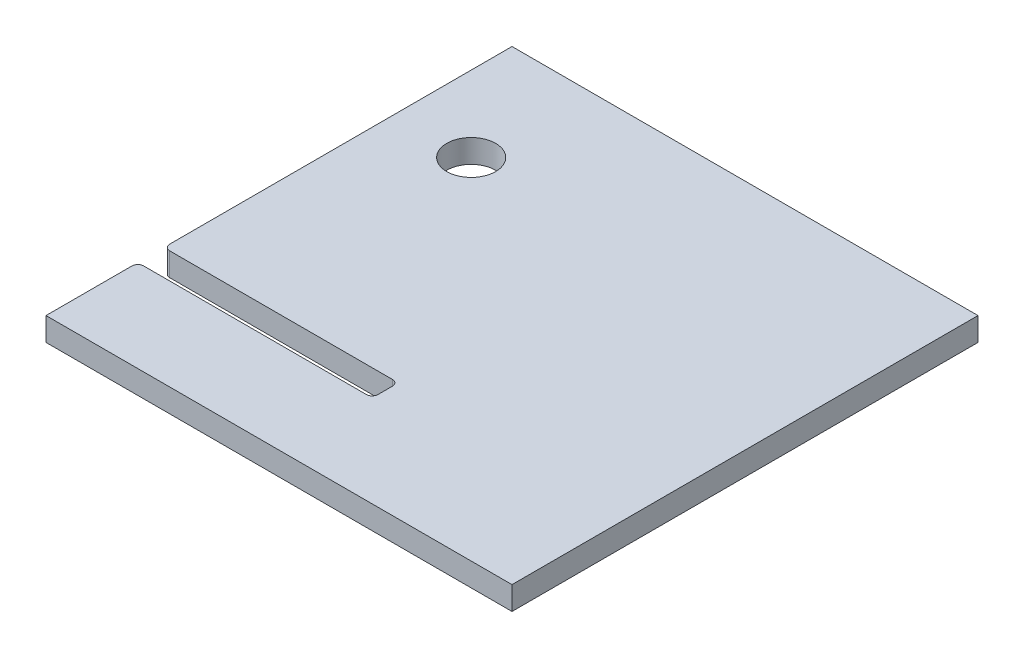
ISO-10303-21;
HEADER;
FILE_DESCRIPTION(('STEP AP214'),'2;1');
FILE_NAME('part.step','',(''),(''),'','','');
FILE_SCHEMA(('AUTOMOTIVE_DESIGN { 1 0 10303 214 1 1 1 1 }'));
ENDSEC;
DATA;
#1=APPLICATION_CONTEXT('core data for automotive mechanical design processes');
#2=APPLICATION_PROTOCOL_DEFINITION('international standard','automotive_design',2000,#1);
#3=PRODUCT_CONTEXT('',#1,'mechanical');
#4=PRODUCT('Part','Part','',(#3));
#5=PRODUCT_RELATED_PRODUCT_CATEGORY('part','',(#4));
#6=PRODUCT_DEFINITION_FORMATION('','',#4);
#7=PRODUCT_DEFINITION_CONTEXT('part definition',#1,'design');
#8=PRODUCT_DEFINITION('design','',#6,#7);
#9=PRODUCT_DEFINITION_SHAPE('','',#8);
#10=(LENGTH_UNIT() NAMED_UNIT(*) SI_UNIT(.MILLI.,.METRE.));
#11=(NAMED_UNIT(*) PLANE_ANGLE_UNIT() SI_UNIT($,.RADIAN.));
#12=(NAMED_UNIT(*) SI_UNIT($,.STERADIAN.) SOLID_ANGLE_UNIT());
#13=UNCERTAINTY_MEASURE_WITH_UNIT(LENGTH_MEASURE(1.E-05),#10,'distance_accuracy_value','');
#14=(GEOMETRIC_REPRESENTATION_CONTEXT(3) GLOBAL_UNCERTAINTY_ASSIGNED_CONTEXT((#13)) GLOBAL_UNIT_ASSIGNED_CONTEXT((#10,
#11,#12)) REPRESENTATION_CONTEXT('',''));
#15=CARTESIAN_POINT('',(0.,0.,0.));
#16=DIRECTION('',(0.,0.,1.));
#17=DIRECTION('',(1.,0.,0.));
#18=AXIS2_PLACEMENT_3D('',#15,#16,#17);
#19=CARTESIAN_POINT('',(-127.,6.35,0.));
#20=DIRECTION('',(1.,0.,0.));
#21=DIRECTION('',(0.,0.,-1.));
#22=AXIS2_PLACEMENT_3D('',#19,#20,#21);
#23=PLANE('',#22);
#24=DIRECTION('',(0.,0.,1.));
#25=VECTOR('',#24,1.);
#26=CARTESIAN_POINT('',(-127.,-6.35,0.));
#27=LINE('',#26,#25);
#28=CARTESIAN_POINT('',(-127.,-6.35,-254.));
#29=VERTEX_POINT('',#28);
#30=CARTESIAN_POINT('',(-127.,-6.35,-67.4369999999983));
#31=VERTEX_POINT('',#30);
#32=EDGE_CURVE('E154',#29,#31,#27,.T.);
#33=ORIENTED_EDGE('',*,*,#32,.T.);
#34=DIRECTION('',(0.,1.,0.));
#35=VECTOR('',#34,1.);
#36=CARTESIAN_POINT('',(-127.,6.35,-67.4369999999983));
#37=LINE('',#36,#35);
#38=CARTESIAN_POINT('',(-127.,6.35,-67.4369999999983));
#39=VERTEX_POINT('',#38);
#40=EDGE_CURVE('E206',#31,#39,#37,.T.);
#41=ORIENTED_EDGE('',*,*,#40,.T.);
#42=DIRECTION('',(0.,0.,1.));
#43=VECTOR('',#42,1.);
#44=CARTESIAN_POINT('',(-127.,6.35,0.));
#45=LINE('',#44,#43);
#46=CARTESIAN_POINT('',(-127.,6.35,-254.));
#47=VERTEX_POINT('',#46);
#48=EDGE_CURVE('E157',#47,#39,#45,.T.);
#49=ORIENTED_EDGE('',*,*,#48,.F.);
#50=DIRECTION('',(0.,-1.,0.));
#51=VECTOR('',#50,1.);
#52=CARTESIAN_POINT('',(-127.,6.35,-254.));
#53=LINE('',#52,#51);
#54=EDGE_CURVE('E142',#47,#29,#53,.T.);
#55=ORIENTED_EDGE('',*,*,#54,.T.);
#56=EDGE_LOOP('',(#33,#41,#49,#55));
#57=FACE_BOUND('',#56,.T.);
#58=ADVANCED_FACE('F45',(#57),#23,.F.);
#59=CARTESIAN_POINT('',(-127.,6.35,-46.8629999999984));
#60=VERTEX_POINT('',#59);
#61=CARTESIAN_POINT('',(-127.,6.35,0.));
#62=VERTEX_POINT('',#61);
#63=EDGE_CURVE('E186',#60,#62,#45,.T.);
#64=ORIENTED_EDGE('',*,*,#63,.F.);
#65=DIRECTION('',(0.,1.,0.));
#66=VECTOR('',#65,1.);
#67=CARTESIAN_POINT('',(-127.,6.35,-46.8629999999984));
#68=LINE('',#67,#66);
#69=CARTESIAN_POINT('',(-127.,-6.35,-46.8629999999984));
#70=VERTEX_POINT('',#69);
#71=EDGE_CURVE('E234',#60,#70,#68,.F.);
#72=ORIENTED_EDGE('',*,*,#71,.T.);
#73=CARTESIAN_POINT('',(-127.,-6.35,0.));
#74=VERTEX_POINT('',#73);
#75=EDGE_CURVE('E167',#70,#74,#27,.T.);
#76=ORIENTED_EDGE('',*,*,#75,.T.);
#77=DIRECTION('',(0.,-1.,0.));
#78=VECTOR('',#77,1.);
#79=CARTESIAN_POINT('',(-127.,6.35,0.));
#80=LINE('',#79,#78);
#81=EDGE_CURVE('E276',#62,#74,#80,.T.);
#82=ORIENTED_EDGE('',*,*,#81,.F.);
#83=EDGE_LOOP('',(#64,#72,#76,#82));
#84=FACE_BOUND('',#83,.T.);
#85=ADVANCED_FACE('F322',(#84),#23,.F.);
#86=CARTESIAN_POINT('',(-127.,6.35,0.));
#87=DIRECTION('',(0.,0.,-1.));
#88=DIRECTION('',(-1.,0.,0.));
#89=AXIS2_PLACEMENT_3D('',#86,#87,#88);
#90=PLANE('',#89);
#91=DIRECTION('',(1.,0.,0.));
#92=VECTOR('',#91,1.);
#93=CARTESIAN_POINT('',(-127.,-6.35,0.));
#94=LINE('',#93,#92);
#95=CARTESIAN_POINT('',(127.,-6.35,0.));
#96=VERTEX_POINT('',#95);
#97=EDGE_CURVE('E159',#74,#96,#94,.T.);
#98=ORIENTED_EDGE('',*,*,#97,.T.);
#99=DIRECTION('',(0.,-1.,0.));
#100=VECTOR('',#99,1.);
#101=CARTESIAN_POINT('',(127.,6.35,0.));
#102=LINE('',#101,#100);
#103=CARTESIAN_POINT('',(127.,6.35,0.));
#104=VERTEX_POINT('',#103);
#105=EDGE_CURVE('E149',#104,#96,#102,.T.);
#106=ORIENTED_EDGE('',*,*,#105,.F.);
#107=DIRECTION('',(1.,0.,0.));
#108=VECTOR('',#107,1.);
#109=CARTESIAN_POINT('',(-127.,6.35,0.));
#110=LINE('',#109,#108);
#111=EDGE_CURVE('E181',#62,#104,#110,.T.);
#112=ORIENTED_EDGE('',*,*,#111,.F.);
#113=ORIENTED_EDGE('',*,*,#81,.T.);
#114=EDGE_LOOP('',(#98,#106,#112,#113));
#115=FACE_BOUND('',#114,.T.);
#116=ADVANCED_FACE('F284',(#115),#90,.F.);
#117=CARTESIAN_POINT('',(127.,6.35,0.));
#118=DIRECTION('',(-1.,0.,0.));
#119=DIRECTION('',(0.,0.,1.));
#120=AXIS2_PLACEMENT_3D('',#117,#118,#119);
#121=PLANE('',#120);
#122=DIRECTION('',(0.,0.,-1.));
#123=VECTOR('',#122,1.);
#124=CARTESIAN_POINT('',(127.,-6.35,0.));
#125=LINE('',#124,#123);
#126=CARTESIAN_POINT('',(127.,-6.35,-254.));
#127=VERTEX_POINT('',#126);
#128=EDGE_CURVE('E269',#96,#127,#125,.T.);
#129=ORIENTED_EDGE('',*,*,#128,.T.);
#130=DIRECTION('',(0.,-1.,0.));
#131=VECTOR('',#130,1.);
#132=CARTESIAN_POINT('',(127.,6.35,-254.));
#133=LINE('',#132,#131);
#134=CARTESIAN_POINT('',(127.,6.35,-254.));
#135=VERTEX_POINT('',#134);
#136=EDGE_CURVE('E145',#135,#127,#133,.T.);
#137=ORIENTED_EDGE('',*,*,#136,.F.);
#138=DIRECTION('',(0.,0.,-1.));
#139=VECTOR('',#138,1.);
#140=CARTESIAN_POINT('',(127.,6.35,0.));
#141=LINE('',#140,#139);
#142=EDGE_CURVE('E178',#104,#135,#141,.T.);
#143=ORIENTED_EDGE('',*,*,#142,.F.);
#144=ORIENTED_EDGE('',*,*,#105,.T.);
#145=EDGE_LOOP('',(#129,#137,#143,#144));
#146=FACE_BOUND('',#145,.T.);
#147=ADVANCED_FACE('F268',(#146),#121,.F.);
#148=CARTESIAN_POINT('',(-127.,6.35,-254.));
#149=DIRECTION('',(0.,0.,1.));
#150=DIRECTION('',(1.,0.,0.));
#151=AXIS2_PLACEMENT_3D('',#148,#149,#150);
#152=PLANE('',#151);
#153=DIRECTION('',(-1.,0.,0.));
#154=VECTOR('',#153,1.);
#155=CARTESIAN_POINT('',(-127.,-6.35,-254.));
#156=LINE('',#155,#154);
#157=EDGE_CURVE('E138',#127,#29,#156,.T.);
#158=ORIENTED_EDGE('',*,*,#157,.T.);
#159=ORIENTED_EDGE('',*,*,#54,.F.);
#160=DIRECTION('',(-1.,0.,0.));
#161=VECTOR('',#160,1.);
#162=CARTESIAN_POINT('',(-127.,6.35,-254.));
#163=LINE('',#162,#161);
#164=EDGE_CURVE('E174',#135,#47,#163,.T.);
#165=ORIENTED_EDGE('',*,*,#164,.F.);
#166=ORIENTED_EDGE('',*,*,#136,.T.);
#167=EDGE_LOOP('',(#158,#159,#165,#166));
#168=FACE_BOUND('',#167,.T.);
#169=ADVANCED_FACE('F140',(#168),#152,.F.);
#170=CARTESIAN_POINT('',(0.,6.35,0.));
#171=DIRECTION('',(0.,-1.,0.));
#172=DIRECTION('',(0.,0.,-1.));
#173=AXIS2_PLACEMENT_3D('',#170,#171,#172);
#174=PLANE('',#173);
#175=CARTESIAN_POINT('',(-85.7499999999946,6.34999999999999,-190.5));
#176=DIRECTION('',(0.,-1.,0.));
#177=DIRECTION('',(0.,0.,-1.));
#178=AXIS2_PLACEMENT_3D('',#175,#176,#177);
#179=CIRCLE('',#178,13.335);
#180=CARTESIAN_POINT('',(-85.7499999999946,6.34999999999999,-203.835));
#181=VERTEX_POINT('',#180);
#182=EDGE_CURVE('E49',#181,#181,#179,.F.);
#183=ORIENTED_EDGE('',*,*,#182,.F.);
#184=EDGE_LOOP('',(#183));
#185=FACE_BOUND('',#184,.T.);
#186=ORIENTED_EDGE('',*,*,#48,.T.);
#187=CARTESIAN_POINT('',(-123.825,6.35,-67.4369999999983));
#188=DIRECTION('',(0.,-1.,0.));
#189=DIRECTION('',(0.,0.,-1.));
#190=AXIS2_PLACEMENT_3D('',#187,#188,#189);
#191=CIRCLE('',#190,3.175);
#192=CARTESIAN_POINT('',(-123.825,6.35,-64.2619999999984));
#193=VERTEX_POINT('',#192);
#194=EDGE_CURVE('E212',#39,#193,#191,.F.);
#195=ORIENTED_EDGE('',*,*,#194,.T.);
#196=DIRECTION('',(-1.,0.,0.));
#197=VECTOR('',#196,1.);
#198=CARTESIAN_POINT('',(-127.,6.35,-64.2619999999984));
#199=LINE('',#198,#197);
#200=CARTESIAN_POINT('',(-2.41300000000011,6.35,-64.2619999999984));
#201=VERTEX_POINT('',#200);
#202=EDGE_CURVE('E193',#201,#193,#199,.T.);
#203=ORIENTED_EDGE('',*,*,#202,.F.);
#204=CARTESIAN_POINT('',(-2.41300000000011,6.35,-61.0869999999983));
#205=DIRECTION('',(0.,-1.,0.));
#206=DIRECTION('',(0.,0.,-1.));
#207=AXIS2_PLACEMENT_3D('',#204,#205,#206);
#208=CIRCLE('',#207,3.175);
#209=CARTESIAN_POINT('',(0.761999999999889,6.35,-61.0869999999983));
#210=VERTEX_POINT('',#209);
#211=EDGE_CURVE('E243',#201,#210,#208,.T.);
#212=ORIENTED_EDGE('',*,*,#211,.T.);
#213=DIRECTION('',(0.,0.,-1.));
#214=VECTOR('',#213,1.);
#215=CARTESIAN_POINT('',(0.761999999999889,6.35,-63.4999999999984));
#216=LINE('',#215,#214);
#217=CARTESIAN_POINT('',(0.761999999999889,6.35,-53.2129999999983));
#218=VERTEX_POINT('',#217);
#219=EDGE_CURVE('E197',#218,#210,#216,.T.);
#220=ORIENTED_EDGE('',*,*,#219,.F.);
#221=CARTESIAN_POINT('',(-2.41300000000011,6.35,-53.2129999999983));
#222=DIRECTION('',(0.,-1.,0.));
#223=DIRECTION('',(0.,0.,-1.));
#224=AXIS2_PLACEMENT_3D('',#221,#222,#223);
#225=CIRCLE('',#224,3.175);
#226=CARTESIAN_POINT('',(-2.41300000000011,6.35,-50.0379999999983));
#227=VERTEX_POINT('',#226);
#228=EDGE_CURVE('E55',#218,#227,#225,.T.);
#229=ORIENTED_EDGE('',*,*,#228,.T.);
#230=DIRECTION('',(1.,0.,0.));
#231=VECTOR('',#230,1.);
#232=CARTESIAN_POINT('',(-127.,6.35,-50.0379999999983));
#233=LINE('',#232,#231);
#234=CARTESIAN_POINT('',(-123.825,6.35,-50.0379999999983));
#235=VERTEX_POINT('',#234);
#236=EDGE_CURVE('E200',#235,#227,#233,.T.);
#237=ORIENTED_EDGE('',*,*,#236,.F.);
#238=CARTESIAN_POINT('',(-123.825,6.35,-46.8629999999984));
#239=DIRECTION('',(0.,-1.,0.));
#240=DIRECTION('',(0.,0.,-1.));
#241=AXIS2_PLACEMENT_3D('',#238,#239,#240);
#242=CIRCLE('',#241,3.175);
#243=EDGE_CURVE('E209',#235,#60,#242,.F.);
#244=ORIENTED_EDGE('',*,*,#243,.T.);
#245=ORIENTED_EDGE('',*,*,#63,.T.);
#246=ORIENTED_EDGE('',*,*,#111,.T.);
#247=ORIENTED_EDGE('',*,*,#142,.T.);
#248=ORIENTED_EDGE('',*,*,#164,.T.);
#249=EDGE_LOOP('',(#186,#195,#203,#212,#220,#229,#237,#244,#245,#246,#247,#248));
#250=FACE_BOUND('',#249,.T.);
#251=ADVANCED_FACE('F258',(#185,#250),#174,.F.);
#252=CARTESIAN_POINT('',(0.,-6.35,0.));
#253=DIRECTION('',(0.,-1.,0.));
#254=DIRECTION('',(0.,0.,-1.));
#255=AXIS2_PLACEMENT_3D('',#252,#253,#254);
#256=PLANE('',#255);
#257=DIRECTION('',(-1.,0.,0.));
#258=VECTOR('',#257,1.);
#259=CARTESIAN_POINT('',(-127.,-6.35,-64.2619999999984));
#260=LINE('',#259,#258);
#261=CARTESIAN_POINT('',(-2.41300000000011,-6.35,-64.2619999999984));
#262=VERTEX_POINT('',#261);
#263=CARTESIAN_POINT('',(-123.825,-6.35,-64.2619999999984));
#264=VERTEX_POINT('',#263);
#265=EDGE_CURVE('E170',#262,#264,#260,.T.);
#266=ORIENTED_EDGE('',*,*,#265,.T.);
#267=CARTESIAN_POINT('',(-123.825,-6.35,-67.4369999999983));
#268=DIRECTION('',(0.,-1.,0.));
#269=DIRECTION('',(0.,0.,-1.));
#270=AXIS2_PLACEMENT_3D('',#267,#268,#269);
#271=CIRCLE('',#270,3.175);
#272=EDGE_CURVE('E165',#264,#31,#271,.T.);
#273=ORIENTED_EDGE('',*,*,#272,.T.);
#274=ORIENTED_EDGE('',*,*,#32,.F.);
#275=ORIENTED_EDGE('',*,*,#157,.F.);
#276=ORIENTED_EDGE('',*,*,#128,.F.);
#277=ORIENTED_EDGE('',*,*,#97,.F.);
#278=ORIENTED_EDGE('',*,*,#75,.F.);
#279=CARTESIAN_POINT('',(-123.825,-6.35,-46.8629999999984));
#280=DIRECTION('',(0.,-1.,0.));
#281=DIRECTION('',(0.,0.,-1.));
#282=AXIS2_PLACEMENT_3D('',#279,#280,#281);
#283=CIRCLE('',#282,3.175);
#284=CARTESIAN_POINT('',(-123.825,-6.35,-50.0379999999983));
#285=VERTEX_POINT('',#284);
#286=EDGE_CURVE('E222',#70,#285,#283,.T.);
#287=ORIENTED_EDGE('',*,*,#286,.T.);
#288=DIRECTION('',(1.,0.,0.));
#289=VECTOR('',#288,1.);
#290=CARTESIAN_POINT('',(-127.,-6.35,-50.0379999999983));
#291=LINE('',#290,#289);
#292=CARTESIAN_POINT('',(-2.41300000000011,-6.35,-50.0379999999983));
#293=VERTEX_POINT('',#292);
#294=EDGE_CURVE('E190',#285,#293,#291,.T.);
#295=ORIENTED_EDGE('',*,*,#294,.T.);
#296=CARTESIAN_POINT('',(-2.41300000000011,-6.35,-53.2129999999983));
#297=DIRECTION('',(0.,-1.,0.));
#298=DIRECTION('',(0.,0.,-1.));
#299=AXIS2_PLACEMENT_3D('',#296,#297,#298);
#300=CIRCLE('',#299,3.175);
#301=CARTESIAN_POINT('',(0.761999999999889,-6.35,-53.2129999999983));
#302=VERTEX_POINT('',#301);
#303=EDGE_CURVE('E12',#293,#302,#300,.F.);
#304=ORIENTED_EDGE('',*,*,#303,.T.);
#305=DIRECTION('',(0.,0.,-1.));
#306=VECTOR('',#305,1.);
#307=CARTESIAN_POINT('',(0.761999999999889,-6.35,-63.4999999999984));
#308=LINE('',#307,#306);
#309=CARTESIAN_POINT('',(0.761999999999889,-6.35,-61.0869999999983));
#310=VERTEX_POINT('',#309);
#311=EDGE_CURVE('E187',#302,#310,#308,.T.);
#312=ORIENTED_EDGE('',*,*,#311,.T.);
#313=CARTESIAN_POINT('',(-2.41300000000011,-6.35,-61.0869999999983));
#314=DIRECTION('',(0.,-1.,0.));
#315=DIRECTION('',(0.,0.,-1.));
#316=AXIS2_PLACEMENT_3D('',#313,#314,#315);
#317=CIRCLE('',#316,3.175);
#318=EDGE_CURVE('E246',#310,#262,#317,.F.);
#319=ORIENTED_EDGE('',*,*,#318,.T.);
#320=EDGE_LOOP('',(#266,#273,#274,#275,#276,#277,#278,#287,#295,#304,#312,#319));
#321=FACE_BOUND('',#320,.T.);
#322=CARTESIAN_POINT('',(-85.7499999999946,-6.34999999999999,-190.5));
#323=DIRECTION('',(0.,-1.,0.));
#324=DIRECTION('',(0.,0.,-1.));
#325=AXIS2_PLACEMENT_3D('',#322,#323,#324);
#326=CIRCLE('',#325,13.335);
#327=CARTESIAN_POINT('',(-85.7499999999946,-6.34999999999999,-203.835));
#328=VERTEX_POINT('',#327);
#329=EDGE_CURVE('E177',#328,#328,#326,.F.);
#330=ORIENTED_EDGE('',*,*,#329,.T.);
#331=EDGE_LOOP('',(#330));
#332=FACE_BOUND('',#331,.T.);
#333=ADVANCED_FACE('F162',(#321,#332),#256,.T.);
#334=CARTESIAN_POINT('',(-85.7499999999946,115.050000000001,-190.5));
#335=DIRECTION('',(0.,-1.,0.));
#336=DIRECTION('',(1.,0.,0.));
#337=AXIS2_PLACEMENT_3D('',#334,#335,#336);
#338=CYLINDRICAL_SURFACE('',#337,13.335);
#339=ORIENTED_EDGE('',*,*,#329,.F.);
#340=EDGE_LOOP('',(#339));
#341=FACE_BOUND('',#340,.T.);
#342=ORIENTED_EDGE('',*,*,#182,.T.);
#343=EDGE_LOOP('',(#342));
#344=FACE_BOUND('',#343,.T.);
#345=ADVANCED_FACE('F47',(#341,#344),#338,.F.);
#346=CARTESIAN_POINT('',(-127.,-6.35,-64.2619999999984));
#347=DIRECTION('',(0.,0.,-1.));
#348=DIRECTION('',(-1.,0.,0.));
#349=AXIS2_PLACEMENT_3D('',#346,#347,#348);
#350=PLANE('',#349);
#351=ORIENTED_EDGE('',*,*,#202,.T.);
#352=DIRECTION('',(0.,1.,0.));
#353=VECTOR('',#352,1.);
#354=CARTESIAN_POINT('',(-123.825,-6.35,-64.2619999999984));
#355=LINE('',#354,#353);
#356=EDGE_CURVE('E219',#193,#264,#355,.F.);
#357=ORIENTED_EDGE('',*,*,#356,.T.);
#358=ORIENTED_EDGE('',*,*,#265,.F.);
#359=DIRECTION('',(0.,1.,0.));
#360=VECTOR('',#359,1.);
#361=CARTESIAN_POINT('',(-2.41300000000011,6.35,-64.2619999999984));
#362=LINE('',#361,#360);
#363=EDGE_CURVE('E215',#262,#201,#362,.T.);
#364=ORIENTED_EDGE('',*,*,#363,.T.);
#365=EDGE_LOOP('',(#351,#357,#358,#364));
#366=FACE_BOUND('',#365,.T.);
#367=ADVANCED_FACE('F309',(#366),#350,.F.);
#368=CARTESIAN_POINT('',(0.761999999999889,-6.35,-63.4999999999984));
#369=DIRECTION('',(1.,0.,0.));
#370=DIRECTION('',(0.,0.,-1.));
#371=AXIS2_PLACEMENT_3D('',#368,#369,#370);
#372=PLANE('',#371);
#373=ORIENTED_EDGE('',*,*,#219,.T.);
#374=DIRECTION('',(0.,1.,0.));
#375=VECTOR('',#374,1.);
#376=CARTESIAN_POINT('',(0.761999999999889,-6.35,-61.0869999999983));
#377=LINE('',#376,#375);
#378=EDGE_CURVE('E63',#210,#310,#377,.F.);
#379=ORIENTED_EDGE('',*,*,#378,.T.);
#380=ORIENTED_EDGE('',*,*,#311,.F.);
#381=DIRECTION('',(0.,1.,0.));
#382=VECTOR('',#381,1.);
#383=CARTESIAN_POINT('',(0.761999999999889,6.35,-53.2129999999983));
#384=LINE('',#383,#382);
#385=EDGE_CURVE('E237',#302,#218,#384,.T.);
#386=ORIENTED_EDGE('',*,*,#385,.T.);
#387=EDGE_LOOP('',(#373,#379,#380,#386));
#388=FACE_BOUND('',#387,.T.);
#389=ADVANCED_FACE('F302',(#388),#372,.F.);
#390=CARTESIAN_POINT('',(-127.,-6.35,-50.0379999999983));
#391=DIRECTION('',(0.,0.,1.));
#392=DIRECTION('',(1.,0.,0.));
#393=AXIS2_PLACEMENT_3D('',#390,#391,#392);
#394=PLANE('',#393);
#395=ORIENTED_EDGE('',*,*,#294,.F.);
#396=DIRECTION('',(0.,1.,0.));
#397=VECTOR('',#396,1.);
#398=CARTESIAN_POINT('',(-123.825,-6.35,-50.0379999999983));
#399=LINE('',#398,#397);
#400=EDGE_CURVE('E230',#285,#235,#399,.T.);
#401=ORIENTED_EDGE('',*,*,#400,.T.);
#402=ORIENTED_EDGE('',*,*,#236,.T.);
#403=DIRECTION('',(0.,1.,0.));
#404=VECTOR('',#403,1.);
#405=CARTESIAN_POINT('',(-2.41300000000011,-6.35,-50.0379999999983));
#406=LINE('',#405,#404);
#407=EDGE_CURVE('E227',#227,#293,#406,.F.);
#408=ORIENTED_EDGE('',*,*,#407,.T.);
#409=EDGE_LOOP('',(#395,#401,#402,#408));
#410=FACE_BOUND('',#409,.T.);
#411=ADVANCED_FACE('F295',(#410),#394,.F.);
#412=CARTESIAN_POINT('',(-123.825,6.35,-67.4369999999983));
#413=DIRECTION('',(0.,1.,0.));
#414=DIRECTION('',(0.,0.,1.));
#415=AXIS2_PLACEMENT_3D('',#412,#413,#414);
#416=CYLINDRICAL_SURFACE('',#415,3.175);
#417=ORIENTED_EDGE('',*,*,#272,.F.);
#418=ORIENTED_EDGE('',*,*,#356,.F.);
#419=ORIENTED_EDGE('',*,*,#194,.F.);
#420=ORIENTED_EDGE('',*,*,#40,.F.);
#421=EDGE_LOOP('',(#417,#418,#419,#420));
#422=FACE_BOUND('',#421,.T.);
#423=ADVANCED_FACE('F312',(#422),#416,.T.);
#424=CARTESIAN_POINT('',(-123.825,-6.35,-46.8629999999984));
#425=DIRECTION('',(0.,1.,0.));
#426=DIRECTION('',(0.,0.,1.));
#427=AXIS2_PLACEMENT_3D('',#424,#425,#426);
#428=CYLINDRICAL_SURFACE('',#427,3.175);
#429=ORIENTED_EDGE('',*,*,#286,.F.);
#430=ORIENTED_EDGE('',*,*,#71,.F.);
#431=ORIENTED_EDGE('',*,*,#243,.F.);
#432=ORIENTED_EDGE('',*,*,#400,.F.);
#433=EDGE_LOOP('',(#429,#430,#431,#432));
#434=FACE_BOUND('',#433,.T.);
#435=ADVANCED_FACE('F292',(#434),#428,.T.);
#436=CARTESIAN_POINT('',(-2.41300000000011,-6.35,-61.0869999999983));
#437=DIRECTION('',(0.,-1.,0.));
#438=DIRECTION('',(0.,0.,-1.));
#439=AXIS2_PLACEMENT_3D('',#436,#437,#438);
#440=CYLINDRICAL_SURFACE('',#439,3.175);
#441=ORIENTED_EDGE('',*,*,#318,.F.);
#442=ORIENTED_EDGE('',*,*,#378,.F.);
#443=ORIENTED_EDGE('',*,*,#211,.F.);
#444=ORIENTED_EDGE('',*,*,#363,.F.);
#445=EDGE_LOOP('',(#441,#442,#443,#444));
#446=FACE_BOUND('',#445,.T.);
#447=ADVANCED_FACE('F307',(#446),#440,.F.);
#448=CARTESIAN_POINT('',(-2.41300000000011,-6.35,-53.2129999999983));
#449=DIRECTION('',(0.,-1.,0.));
#450=DIRECTION('',(0.,0.,-1.));
#451=AXIS2_PLACEMENT_3D('',#448,#449,#450);
#452=CYLINDRICAL_SURFACE('',#451,3.175);
#453=ORIENTED_EDGE('',*,*,#303,.F.);
#454=ORIENTED_EDGE('',*,*,#407,.F.);
#455=ORIENTED_EDGE('',*,*,#228,.F.);
#456=ORIENTED_EDGE('',*,*,#385,.F.);
#457=EDGE_LOOP('',(#453,#454,#455,#456));
#458=FACE_BOUND('',#457,.T.);
#459=ADVANCED_FACE('F301',(#458),#452,.F.);
#460=CLOSED_SHELL('',(#58,#85,#116,#147,#169,#251,#333,#345,#367,#389,#411,#423,#435,#447,#459));
#461=MANIFOLD_SOLID_BREP('B2',#460);
#462=ADVANCED_BREP_SHAPE_REPRESENTATION('',(#18,#461),#14);
#463=SHAPE_DEFINITION_REPRESENTATION(#9,#462);
ENDSEC;
END-ISO-10303-21;
